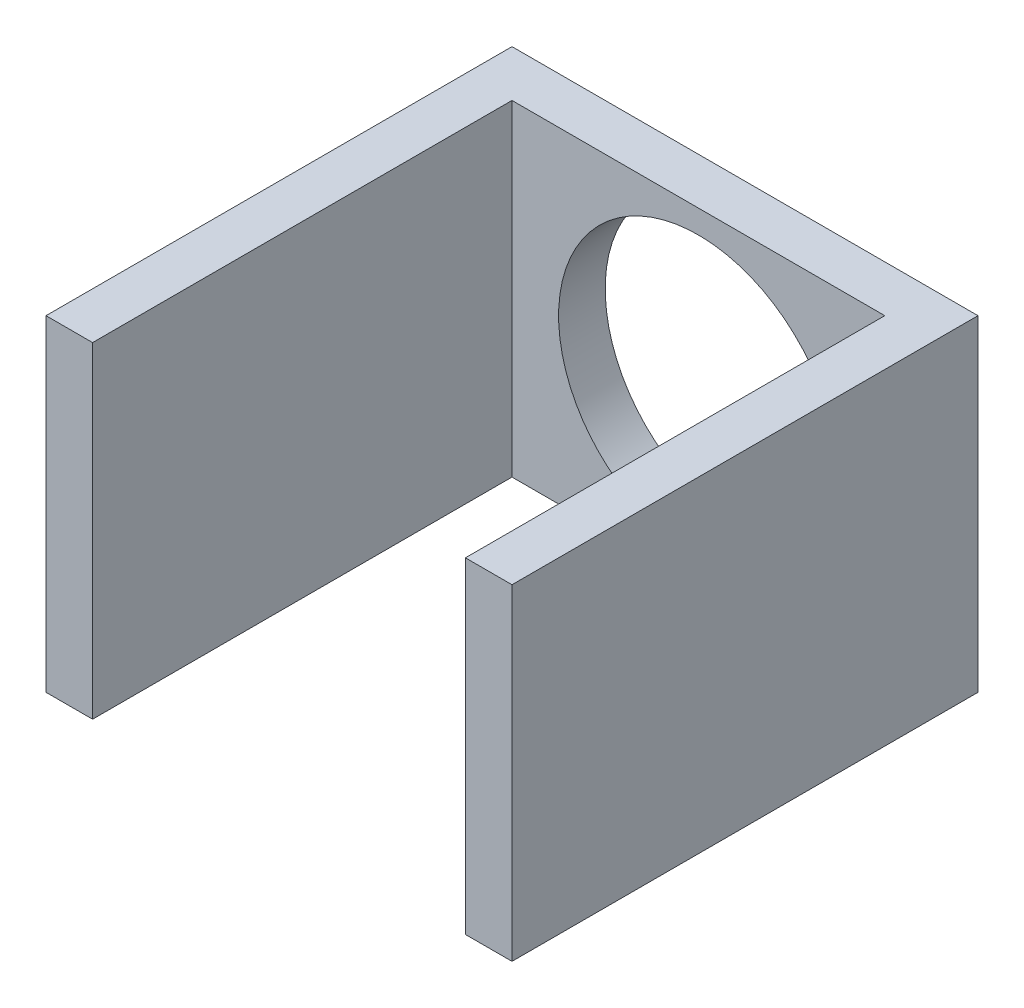
ISO-10303-21;
HEADER;
FILE_DESCRIPTION(('STEP AP214'),'2;1');
FILE_NAME('part.step','',(''),(''),'','','');
FILE_SCHEMA(('AUTOMOTIVE_DESIGN { 1 0 10303 214 1 1 1 1 }'));
ENDSEC;
DATA;
#1=APPLICATION_CONTEXT('core data for automotive mechanical design processes');
#2=APPLICATION_PROTOCOL_DEFINITION('international standard','automotive_design',2000,#1);
#3=PRODUCT_CONTEXT('',#1,'mechanical');
#4=PRODUCT('Part','Part','',(#3));
#5=PRODUCT_RELATED_PRODUCT_CATEGORY('part','',(#4));
#6=PRODUCT_DEFINITION_FORMATION('','',#4);
#7=PRODUCT_DEFINITION_CONTEXT('part definition',#1,'design');
#8=PRODUCT_DEFINITION('design','',#6,#7);
#9=PRODUCT_DEFINITION_SHAPE('','',#8);
#10=(LENGTH_UNIT() NAMED_UNIT(*) SI_UNIT(.MILLI.,.METRE.));
#11=(NAMED_UNIT(*) PLANE_ANGLE_UNIT() SI_UNIT($,.RADIAN.));
#12=(NAMED_UNIT(*) SI_UNIT($,.STERADIAN.) SOLID_ANGLE_UNIT());
#13=UNCERTAINTY_MEASURE_WITH_UNIT(LENGTH_MEASURE(1.E-05),#10,'distance_accuracy_value','');
#14=(GEOMETRIC_REPRESENTATION_CONTEXT(3) GLOBAL_UNCERTAINTY_ASSIGNED_CONTEXT((#13)) GLOBAL_UNIT_ASSIGNED_CONTEXT((#10,
#11,#12)) REPRESENTATION_CONTEXT('',''));
#15=CARTESIAN_POINT('',(0.,0.,0.));
#16=DIRECTION('',(0.,0.,1.));
#17=DIRECTION('',(1.,0.,0.));
#18=AXIS2_PLACEMENT_3D('',#15,#16,#17);
#19=CARTESIAN_POINT('',(0.,70.,10.));
#20=DIRECTION('',(0.,-1.,0.));
#21=DIRECTION('',(1.,0.,0.));
#22=AXIS2_PLACEMENT_3D('',#19,#20,#21);
#23=PLANE('',#22);
#24=DIRECTION('',(-1.,0.,0.));
#25=VECTOR('',#24,1.);
#26=CARTESIAN_POINT('',(0.,70.,0.));
#27=LINE('',#26,#25);
#28=CARTESIAN_POINT('',(0.,70.,0.));
#29=VERTEX_POINT('',#28);
#30=CARTESIAN_POINT('',(-100.,70.,0.));
#31=VERTEX_POINT('',#30);
#32=EDGE_CURVE('E162',#29,#31,#27,.T.);
#33=ORIENTED_EDGE('',*,*,#32,.T.);
#34=DIRECTION('',(0.,0.,-1.));
#35=VECTOR('',#34,1.);
#36=CARTESIAN_POINT('',(-100.,70.,100.));
#37=LINE('',#36,#35);
#38=CARTESIAN_POINT('',(-100.,70.,100.));
#39=VERTEX_POINT('',#38);
#40=EDGE_CURVE('E131',#39,#31,#37,.T.);
#41=ORIENTED_EDGE('',*,*,#40,.F.);
#42=DIRECTION('',(-1.,0.,0.));
#43=VECTOR('',#42,1.);
#44=CARTESIAN_POINT('',(0.,70.,100.));
#45=LINE('',#44,#43);
#46=CARTESIAN_POINT('',(-90.,70.,100.));
#47=VERTEX_POINT('',#46);
#48=EDGE_CURVE('E121',#47,#39,#45,.T.);
#49=ORIENTED_EDGE('',*,*,#48,.F.);
#50=DIRECTION('',(0.,0.,-1.));
#51=VECTOR('',#50,1.);
#52=CARTESIAN_POINT('',(-90.,70.,100.));
#53=LINE('',#52,#51);
#54=CARTESIAN_POINT('',(-90.,70.,9.99999999999999));
#55=VERTEX_POINT('',#54);
#56=EDGE_CURVE('E135',#47,#55,#53,.T.);
#57=ORIENTED_EDGE('',*,*,#56,.T.);
#58=DIRECTION('',(-1.,0.,0.));
#59=VECTOR('',#58,1.);
#60=CARTESIAN_POINT('',(0.,70.,10.));
#61=LINE('',#60,#59);
#62=CARTESIAN_POINT('',(-9.99999999999998,70.,10.));
#63=VERTEX_POINT('',#62);
#64=EDGE_CURVE('E59',#63,#55,#61,.T.);
#65=ORIENTED_EDGE('',*,*,#64,.F.);
#66=DIRECTION('',(0.,0.,-1.));
#67=VECTOR('',#66,1.);
#68=CARTESIAN_POINT('',(-9.99999999999998,70.,100.));
#69=LINE('',#68,#67);
#70=CARTESIAN_POINT('',(-9.99999999999998,70.,100.));
#71=VERTEX_POINT('',#70);
#72=EDGE_CURVE('E159',#71,#63,#69,.T.);
#73=ORIENTED_EDGE('',*,*,#72,.F.);
#74=DIRECTION('',(-1.,0.,0.));
#75=VECTOR('',#74,1.);
#76=CARTESIAN_POINT('',(0.,70.,100.));
#77=LINE('',#76,#75);
#78=CARTESIAN_POINT('',(0.,70.,100.));
#79=VERTEX_POINT('',#78);
#80=EDGE_CURVE('E138',#79,#71,#77,.T.);
#81=ORIENTED_EDGE('',*,*,#80,.F.);
#82=DIRECTION('',(0.,0.,-1.));
#83=VECTOR('',#82,1.);
#84=CARTESIAN_POINT('',(0.,70.,100.));
#85=LINE('',#84,#83);
#86=EDGE_CURVE('E148',#79,#29,#85,.T.);
#87=ORIENTED_EDGE('',*,*,#86,.T.);
#88=EDGE_LOOP('',(#33,#41,#49,#57,#65,#73,#81,#87));
#89=FACE_BOUND('',#88,.T.);
#90=ADVANCED_FACE('F35',(#89),#23,.F.);
#91=CARTESIAN_POINT('',(0.,0.,10.));
#92=DIRECTION('',(0.,-1.,0.));
#93=DIRECTION('',(1.,0.,0.));
#94=AXIS2_PLACEMENT_3D('',#91,#92,#93);
#95=PLANE('',#94);
#96=DIRECTION('',(-1.,0.,0.));
#97=VECTOR('',#96,1.);
#98=CARTESIAN_POINT('',(0.,0.,0.));
#99=LINE('',#98,#97);
#100=CARTESIAN_POINT('',(0.,0.,0.));
#101=VERTEX_POINT('',#100);
#102=CARTESIAN_POINT('',(-100.,0.,0.));
#103=VERTEX_POINT('',#102);
#104=EDGE_CURVE('E38',#101,#103,#99,.T.);
#105=ORIENTED_EDGE('',*,*,#104,.F.);
#106=DIRECTION('',(0.,0.,-1.));
#107=VECTOR('',#106,1.);
#108=CARTESIAN_POINT('',(0.,0.,100.));
#109=LINE('',#108,#107);
#110=CARTESIAN_POINT('',(0.,0.,100.));
#111=VERTEX_POINT('',#110);
#112=EDGE_CURVE('E153',#111,#101,#109,.T.);
#113=ORIENTED_EDGE('',*,*,#112,.F.);
#114=DIRECTION('',(-1.,0.,0.));
#115=VECTOR('',#114,1.);
#116=CARTESIAN_POINT('',(0.,0.,100.));
#117=LINE('',#116,#115);
#118=CARTESIAN_POINT('',(-9.99999999999998,0.,100.));
#119=VERTEX_POINT('',#118);
#120=EDGE_CURVE('E143',#111,#119,#117,.T.);
#121=ORIENTED_EDGE('',*,*,#120,.T.);
#122=DIRECTION('',(0.,0.,-1.));
#123=VECTOR('',#122,1.);
#124=CARTESIAN_POINT('',(-9.99999999999998,0.,100.));
#125=LINE('',#124,#123);
#126=CARTESIAN_POINT('',(-9.99999999999998,0.,9.99999999999999));
#127=VERTEX_POINT('',#126);
#128=EDGE_CURVE('E156',#119,#127,#125,.T.);
#129=ORIENTED_EDGE('',*,*,#128,.T.);
#130=DIRECTION('',(-1.,0.,0.));
#131=VECTOR('',#130,1.);
#132=CARTESIAN_POINT('',(0.,0.,10.));
#133=LINE('',#132,#131);
#134=CARTESIAN_POINT('',(-90.,0.,10.));
#135=VERTEX_POINT('',#134);
#136=EDGE_CURVE('E11',#127,#135,#133,.T.);
#137=ORIENTED_EDGE('',*,*,#136,.T.);
#138=DIRECTION('',(0.,0.,-1.));
#139=VECTOR('',#138,1.);
#140=CARTESIAN_POINT('',(-90.,0.,100.));
#141=LINE('',#140,#139);
#142=CARTESIAN_POINT('',(-90.,0.,100.));
#143=VERTEX_POINT('',#142);
#144=EDGE_CURVE('E51',#143,#135,#141,.T.);
#145=ORIENTED_EDGE('',*,*,#144,.F.);
#146=DIRECTION('',(-1.,0.,0.));
#147=VECTOR('',#146,1.);
#148=CARTESIAN_POINT('',(0.,0.,100.));
#149=LINE('',#148,#147);
#150=CARTESIAN_POINT('',(-100.,0.,100.));
#151=VERTEX_POINT('',#150);
#152=EDGE_CURVE('E119',#143,#151,#149,.T.);
#153=ORIENTED_EDGE('',*,*,#152,.T.);
#154=DIRECTION('',(0.,0.,-1.));
#155=VECTOR('',#154,1.);
#156=CARTESIAN_POINT('',(-100.,0.,100.));
#157=LINE('',#156,#155);
#158=EDGE_CURVE('E104',#151,#103,#157,.T.);
#159=ORIENTED_EDGE('',*,*,#158,.T.);
#160=EDGE_LOOP('',(#105,#113,#121,#129,#137,#145,#153,#159));
#161=FACE_BOUND('',#160,.T.);
#162=ADVANCED_FACE('F124',(#161),#95,.T.);
#163=CARTESIAN_POINT('',(0.,0.,10.));
#164=DIRECTION('',(0.,0.,1.));
#165=DIRECTION('',(1.,0.,0.));
#166=AXIS2_PLACEMENT_3D('',#163,#164,#165);
#167=PLANE('',#166);
#168=CARTESIAN_POINT('',(-50.,35.,9.99999999999999));
#169=DIRECTION('',(0.,0.,1.));
#170=DIRECTION('',(1.,0.,0.));
#171=AXIS2_PLACEMENT_3D('',#168,#169,#170);
#172=CIRCLE('',#171,30.);
#173=CARTESIAN_POINT('',(-20.,35.,9.99999999999999));
#174=VERTEX_POINT('',#173);
#175=EDGE_CURVE('E133',#174,#174,#172,.T.);
#176=ORIENTED_EDGE('',*,*,#175,.F.);
#177=EDGE_LOOP('',(#176));
#178=FACE_BOUND('',#177,.T.);
#179=DIRECTION('',(0.,-1.,0.));
#180=VECTOR('',#179,1.);
#181=CARTESIAN_POINT('',(-9.99999999999997,0.,10.));
#182=LINE('',#181,#180);
#183=EDGE_CURVE('E163',#63,#127,#182,.T.);
#184=ORIENTED_EDGE('',*,*,#183,.F.);
#185=ORIENTED_EDGE('',*,*,#64,.T.);
#186=DIRECTION('',(0.,-1.,0.));
#187=VECTOR('',#186,1.);
#188=CARTESIAN_POINT('',(-90.,0.,10.));
#189=LINE('',#188,#187);
#190=EDGE_CURVE('E43',#55,#135,#189,.T.);
#191=ORIENTED_EDGE('',*,*,#190,.T.);
#192=ORIENTED_EDGE('',*,*,#136,.F.);
#193=EDGE_LOOP('',(#184,#185,#191,#192));
#194=FACE_BOUND('',#193,.T.);
#195=ADVANCED_FACE('F182',(#178,#194),#167,.T.);
#196=CARTESIAN_POINT('',(0.,0.,0.));
#197=DIRECTION('',(0.,0.,1.));
#198=DIRECTION('',(1.,0.,0.));
#199=AXIS2_PLACEMENT_3D('',#196,#197,#198);
#200=PLANE('',#199);
#201=CARTESIAN_POINT('',(-50.,35.,0.));
#202=DIRECTION('',(0.,0.,1.));
#203=DIRECTION('',(1.,0.,0.));
#204=AXIS2_PLACEMENT_3D('',#201,#202,#203);
#205=CIRCLE('',#204,30.);
#206=CARTESIAN_POINT('',(-20.,35.,0.));
#207=VERTEX_POINT('',#206);
#208=EDGE_CURVE('E217',#207,#207,#205,.T.);
#209=ORIENTED_EDGE('',*,*,#208,.T.);
#210=EDGE_LOOP('',(#209));
#211=FACE_BOUND('',#210,.T.);
#212=ORIENTED_EDGE('',*,*,#32,.F.);
#213=DIRECTION('',(0.,1.,0.));
#214=VECTOR('',#213,1.);
#215=CARTESIAN_POINT('',(0.,0.,0.));
#216=LINE('',#215,#214);
#217=EDGE_CURVE('E113',#101,#29,#216,.T.);
#218=ORIENTED_EDGE('',*,*,#217,.F.);
#219=ORIENTED_EDGE('',*,*,#104,.T.);
#220=DIRECTION('',(0.,1.,0.));
#221=VECTOR('',#220,1.);
#222=CARTESIAN_POINT('',(-100.,0.,0.));
#223=LINE('',#222,#221);
#224=EDGE_CURVE('E110',#103,#31,#223,.T.);
#225=ORIENTED_EDGE('',*,*,#224,.T.);
#226=EDGE_LOOP('',(#212,#218,#219,#225));
#227=FACE_BOUND('',#226,.T.);
#228=ADVANCED_FACE('F169',(#211,#227),#200,.F.);
#229=CARTESIAN_POINT('',(-9.99999999999997,0.,100.));
#230=DIRECTION('',(1.,0.,0.));
#231=DIRECTION('',(0.,1.,0.));
#232=AXIS2_PLACEMENT_3D('',#229,#230,#231);
#233=PLANE('',#232);
#234=ORIENTED_EDGE('',*,*,#72,.T.);
#235=ORIENTED_EDGE('',*,*,#183,.T.);
#236=ORIENTED_EDGE('',*,*,#128,.F.);
#237=DIRECTION('',(0.,-1.,0.));
#238=VECTOR('',#237,1.);
#239=CARTESIAN_POINT('',(-9.99999999999997,0.,100.));
#240=LINE('',#239,#238);
#241=EDGE_CURVE('E141',#71,#119,#240,.T.);
#242=ORIENTED_EDGE('',*,*,#241,.F.);
#243=EDGE_LOOP('',(#234,#235,#236,#242));
#244=FACE_BOUND('',#243,.T.);
#245=ADVANCED_FACE('F180',(#244),#233,.F.);
#246=CARTESIAN_POINT('',(0.,0.,100.));
#247=DIRECTION('',(-1.,0.,0.));
#248=DIRECTION('',(0.,0.,1.));
#249=AXIS2_PLACEMENT_3D('',#246,#247,#248);
#250=PLANE('',#249);
#251=ORIENTED_EDGE('',*,*,#217,.T.);
#252=ORIENTED_EDGE('',*,*,#86,.F.);
#253=DIRECTION('',(0.,1.,0.));
#254=VECTOR('',#253,1.);
#255=CARTESIAN_POINT('',(0.,0.,100.));
#256=LINE('',#255,#254);
#257=EDGE_CURVE('E146',#111,#79,#256,.T.);
#258=ORIENTED_EDGE('',*,*,#257,.F.);
#259=ORIENTED_EDGE('',*,*,#112,.T.);
#260=EDGE_LOOP('',(#251,#252,#258,#259));
#261=FACE_BOUND('',#260,.T.);
#262=ADVANCED_FACE('F172',(#261),#250,.F.);
#263=CARTESIAN_POINT('',(0.,0.,100.));
#264=DIRECTION('',(0.,0.,1.));
#265=DIRECTION('',(1.,0.,0.));
#266=AXIS2_PLACEMENT_3D('',#263,#264,#265);
#267=PLANE('',#266);
#268=ORIENTED_EDGE('',*,*,#80,.T.);
#269=ORIENTED_EDGE('',*,*,#241,.T.);
#270=ORIENTED_EDGE('',*,*,#120,.F.);
#271=ORIENTED_EDGE('',*,*,#257,.T.);
#272=EDGE_LOOP('',(#268,#269,#270,#271));
#273=FACE_BOUND('',#272,.T.);
#274=ADVANCED_FACE('F177',(#273),#267,.T.);
#275=CARTESIAN_POINT('',(-90.,0.,100.));
#276=DIRECTION('',(1.,0.,0.));
#277=DIRECTION('',(0.,0.,-1.));
#278=AXIS2_PLACEMENT_3D('',#275,#276,#277);
#279=PLANE('',#278);
#280=ORIENTED_EDGE('',*,*,#190,.F.);
#281=ORIENTED_EDGE('',*,*,#56,.F.);
#282=DIRECTION('',(0.,-1.,0.));
#283=VECTOR('',#282,1.);
#284=CARTESIAN_POINT('',(-90.,0.,100.));
#285=LINE('',#284,#283);
#286=EDGE_CURVE('E125',#47,#143,#285,.T.);
#287=ORIENTED_EDGE('',*,*,#286,.T.);
#288=ORIENTED_EDGE('',*,*,#144,.T.);
#289=EDGE_LOOP('',(#280,#281,#287,#288));
#290=FACE_BOUND('',#289,.T.);
#291=ADVANCED_FACE('F183',(#290),#279,.T.);
#292=CARTESIAN_POINT('',(-100.,0.,100.));
#293=DIRECTION('',(-1.,0.,0.));
#294=DIRECTION('',(0.,0.,1.));
#295=AXIS2_PLACEMENT_3D('',#292,#293,#294);
#296=PLANE('',#295);
#297=ORIENTED_EDGE('',*,*,#224,.F.);
#298=ORIENTED_EDGE('',*,*,#158,.F.);
#299=DIRECTION('',(0.,1.,0.));
#300=VECTOR('',#299,1.);
#301=CARTESIAN_POINT('',(-100.,0.,100.));
#302=LINE('',#301,#300);
#303=EDGE_CURVE('E108',#151,#39,#302,.T.);
#304=ORIENTED_EDGE('',*,*,#303,.T.);
#305=ORIENTED_EDGE('',*,*,#40,.T.);
#306=EDGE_LOOP('',(#297,#298,#304,#305));
#307=FACE_BOUND('',#306,.T.);
#308=ADVANCED_FACE('F106',(#307),#296,.T.);
#309=CARTESIAN_POINT('',(0.,0.,100.));
#310=DIRECTION('',(0.,0.,1.));
#311=DIRECTION('',(1.,0.,0.));
#312=AXIS2_PLACEMENT_3D('',#309,#310,#311);
#313=PLANE('',#312);
#314=ORIENTED_EDGE('',*,*,#303,.F.);
#315=ORIENTED_EDGE('',*,*,#152,.F.);
#316=ORIENTED_EDGE('',*,*,#286,.F.);
#317=ORIENTED_EDGE('',*,*,#48,.T.);
#318=EDGE_LOOP('',(#314,#315,#316,#317));
#319=FACE_BOUND('',#318,.T.);
#320=ADVANCED_FACE('F117',(#319),#313,.T.);
#321=CARTESIAN_POINT('',(-50.,35.,94.8528137423857));
#322=DIRECTION('',(0.,0.,-1.));
#323=DIRECTION('',(-1.,0.,0.));
#324=AXIS2_PLACEMENT_3D('',#321,#322,#323);
#325=CYLINDRICAL_SURFACE('',#324,30.);
#326=ORIENTED_EDGE('',*,*,#208,.F.);
#327=EDGE_LOOP('',(#326));
#328=FACE_BOUND('',#327,.T.);
#329=ORIENTED_EDGE('',*,*,#175,.T.);
#330=EDGE_LOOP('',(#329));
#331=FACE_BOUND('',#330,.T.);
#332=ADVANCED_FACE('F209',(#328,#331),#325,.F.);
#333=CLOSED_SHELL('',(#90,#162,#195,#228,#245,#262,#274,#291,#308,#320,#332));
#334=MANIFOLD_SOLID_BREP('B2',#333);
#335=ADVANCED_BREP_SHAPE_REPRESENTATION('',(#18,#334),#14);
#336=SHAPE_DEFINITION_REPRESENTATION(#9,#335);
ENDSEC;
END-ISO-10303-21;
